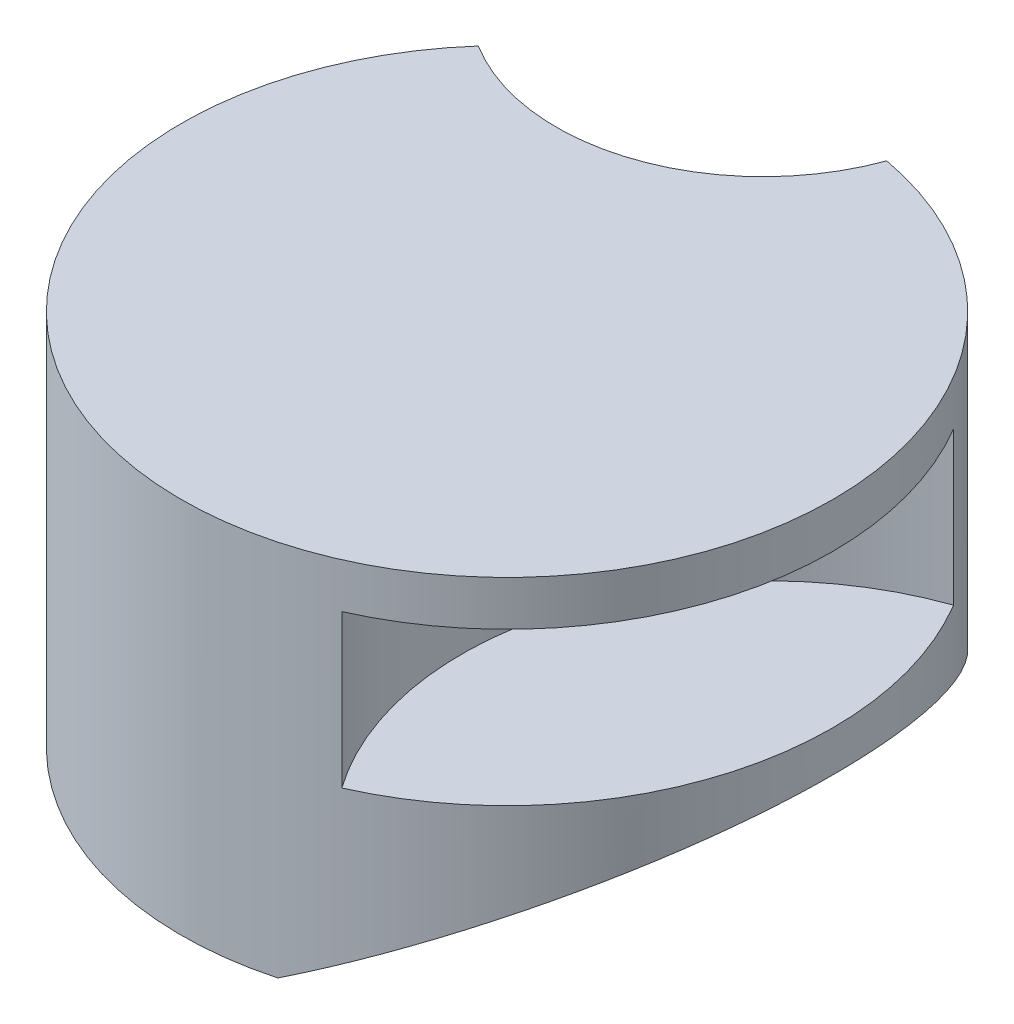
ISO-10303-21;
HEADER;
FILE_DESCRIPTION(('STEP AP214'),'2;1');
FILE_NAME('part.step','',(''),(''),'','','');
FILE_SCHEMA(('AUTOMOTIVE_DESIGN { 1 0 10303 214 1 1 1 1 }'));
ENDSEC;
DATA;
#1=APPLICATION_CONTEXT('core data for automotive mechanical design processes');
#2=APPLICATION_PROTOCOL_DEFINITION('international standard','automotive_design',2000,#1);
#3=PRODUCT_CONTEXT('',#1,'mechanical');
#4=PRODUCT('Part','Part','',(#3));
#5=PRODUCT_RELATED_PRODUCT_CATEGORY('part','',(#4));
#6=PRODUCT_DEFINITION_FORMATION('','',#4);
#7=PRODUCT_DEFINITION_CONTEXT('part definition',#1,'design');
#8=PRODUCT_DEFINITION('design','',#6,#7);
#9=PRODUCT_DEFINITION_SHAPE('','',#8);
#10=(LENGTH_UNIT() NAMED_UNIT(*) SI_UNIT(.MILLI.,.METRE.));
#11=(NAMED_UNIT(*) PLANE_ANGLE_UNIT() SI_UNIT($,.RADIAN.));
#12=(NAMED_UNIT(*) SI_UNIT($,.STERADIAN.) SOLID_ANGLE_UNIT());
#13=UNCERTAINTY_MEASURE_WITH_UNIT(LENGTH_MEASURE(1.E-05),#10,'distance_accuracy_value','');
#14=(GEOMETRIC_REPRESENTATION_CONTEXT(3) GLOBAL_UNCERTAINTY_ASSIGNED_CONTEXT((#13)) GLOBAL_UNIT_ASSIGNED_CONTEXT((#10,
#11,#12)) REPRESENTATION_CONTEXT('',''));
#15=CARTESIAN_POINT('',(0.,0.,0.));
#16=DIRECTION('',(0.,0.,1.));
#17=DIRECTION('',(1.,0.,0.));
#18=AXIS2_PLACEMENT_3D('',#15,#16,#17);
#19=CARTESIAN_POINT('',(-30.,84.,-87.));
#20=DIRECTION('',(0.,-1.,0.));
#21=DIRECTION('',(0.,0.,-1.));
#22=AXIS2_PLACEMENT_3D('',#19,#20,#21);
#23=CYLINDRICAL_SURFACE('',#22,46.);
#24=CARTESIAN_POINT('',(-30.,0.,-87.));
#25=DIRECTION('',(0.,-1.,0.));
#26=DIRECTION('',(0.,0.,1.));
#27=AXIS2_PLACEMENT_3D('',#24,#25,#26);
#28=CIRCLE('',#27,46.);
#29=CARTESIAN_POINT('',(13.2314324490294,0.,-71.2823904996653));
#30=VERTEX_POINT('',#29);
#31=CARTESIAN_POINT('',(-54.3552369123662,0.,-47.9766424440116));
#32=VERTEX_POINT('',#31);
#33=EDGE_CURVE('E179',#30,#32,#28,.T.);
#34=ORIENTED_EDGE('',*,*,#33,.T.);
#35=DIRECTION('',(0.,-1.,0.));
#36=VECTOR('',#35,1.);
#37=CARTESIAN_POINT('',(-54.3552369123662,84.,-47.9766424440116));
#38=LINE('',#37,#36);
#39=CARTESIAN_POINT('',(-54.3552369123662,84.,-47.9766424440116));
#40=VERTEX_POINT('',#39);
#41=EDGE_CURVE('E47',#40,#32,#38,.T.);
#42=ORIENTED_EDGE('',*,*,#41,.F.);
#43=CARTESIAN_POINT('',(-30.,84.,-87.));
#44=DIRECTION('',(0.,-1.,0.));
#45=DIRECTION('',(0.,0.,1.));
#46=AXIS2_PLACEMENT_3D('',#43,#44,#45);
#47=CIRCLE('',#46,46.);
#48=CARTESIAN_POINT('',(13.2314324490294,84.,-71.2823904996653));
#49=VERTEX_POINT('',#48);
#50=EDGE_CURVE('E181',#49,#40,#47,.T.);
#51=ORIENTED_EDGE('',*,*,#50,.F.);
#52=DIRECTION('',(0.,-1.,0.));
#53=VECTOR('',#52,1.);
#54=CARTESIAN_POINT('',(13.2314324490294,84.,-71.2823904996653));
#55=LINE('',#54,#53);
#56=EDGE_CURVE('E187',#49,#30,#55,.T.);
#57=ORIENTED_EDGE('',*,*,#56,.T.);
#58=EDGE_LOOP('',(#34,#42,#51,#57));
#59=FACE_BOUND('',#58,.T.);
#60=ADVANCED_FACE('F40',(#59),#23,.F.);
#61=CARTESIAN_POINT('',(0.,84.,0.));
#62=DIRECTION('',(0.,-1.,0.));
#63=DIRECTION('',(0.,0.,-1.));
#64=AXIS2_PLACEMENT_3D('',#61,#62,#63);
#65=CYLINDRICAL_SURFACE('',#64,72.5);
#66=DIRECTION('',(0.,1.,0.));
#67=VECTOR('',#66,1.);
#68=CARTESIAN_POINT('',(62.2907728367391,40.,-37.0959515230675));
#69=LINE('',#68,#67);
#70=CARTESIAN_POINT('',(62.2907728367391,40.,-37.0959515230675));
#71=VERTEX_POINT('',#70);
#72=CARTESIAN_POINT('',(62.2907728367391,74.,-37.0959515230675));
#73=VERTEX_POINT('',#72);
#74=EDGE_CURVE('E172',#71,#73,#69,.T.);
#75=ORIENTED_EDGE('',*,*,#74,.F.);
#76=CARTESIAN_POINT('',(0.,40.,0.));
#77=DIRECTION('',(0.,1.,0.));
#78=DIRECTION('',(0.,0.,-1.));
#79=AXIS2_PLACEMENT_3D('',#76,#77,#78);
#80=CIRCLE('',#79,72.5);
#81=CARTESIAN_POINT('',(29.4657333236834,40.,66.2421358328487));
#82=VERTEX_POINT('',#81);
#83=EDGE_CURVE('E167',#82,#71,#80,.T.);
#84=ORIENTED_EDGE('',*,*,#83,.F.);
#85=DIRECTION('',(0.,1.,0.));
#86=VECTOR('',#85,1.);
#87=CARTESIAN_POINT('',(29.4657333236834,40.,66.2421358328487));
#88=LINE('',#87,#86);
#89=CARTESIAN_POINT('',(29.4657333236834,74.,66.2421358328487));
#90=VERTEX_POINT('',#89);
#91=EDGE_CURVE('E176',#82,#90,#88,.T.);
#92=ORIENTED_EDGE('',*,*,#91,.T.);
#93=CARTESIAN_POINT('',(0.,74.,0.));
#94=DIRECTION('',(0.,1.,0.));
#95=DIRECTION('',(0.,0.,-1.));
#96=AXIS2_PLACEMENT_3D('',#93,#94,#95);
#97=CIRCLE('',#96,72.5);
#98=EDGE_CURVE('E166',#90,#73,#97,.T.);
#99=ORIENTED_EDGE('',*,*,#98,.T.);
#100=EDGE_LOOP('',(#75,#84,#92,#99));
#101=FACE_BOUND('',#100,.T.);
#102=CARTESIAN_POINT('',(0.,0.,0.));
#103=DIRECTION('',(0.,1.,0.));
#104=DIRECTION('',(0.,0.,1.));
#105=AXIS2_PLACEMENT_3D('',#102,#103,#104);
#106=CIRCLE('',#105,72.5);
#107=CARTESIAN_POINT('',(18.9651148571204,0.,69.9755272824452));
#108=VERTEX_POINT('',#107);
#109=EDGE_CURVE('E185',#32,#108,#106,.T.);
#110=ORIENTED_EDGE('',*,*,#109,.T.);
#111=CARTESIAN_POINT('',(0.,-10.9495141679705,0.));
#112=DIRECTION('',(-0.499999999999995,0.866025403784442,0.));
#113=DIRECTION('',(-0.866025403784442,-0.499999999999995,0.));
#114=AXIS2_PLACEMENT_3D('',#111,#112,#113);
#115=ELLIPSE('',#114,83.7157890324955,72.5);
#116=CARTESIAN_POINT('',(18.9651148571204,0.,-69.9755272824452));
#117=VERTEX_POINT('',#116);
#118=EDGE_CURVE('E53',#108,#117,#115,.T.);
#119=ORIENTED_EDGE('',*,*,#118,.T.);
#120=EDGE_CURVE('E190',#117,#30,#106,.T.);
#121=ORIENTED_EDGE('',*,*,#120,.T.);
#122=ORIENTED_EDGE('',*,*,#56,.F.);
#123=CARTESIAN_POINT('',(0.,84.,0.));
#124=DIRECTION('',(0.,1.,0.));
#125=DIRECTION('',(0.,0.,1.));
#126=AXIS2_PLACEMENT_3D('',#123,#124,#125);
#127=CIRCLE('',#126,72.5);
#128=EDGE_CURVE('E184',#40,#49,#127,.T.);
#129=ORIENTED_EDGE('',*,*,#128,.F.);
#130=ORIENTED_EDGE('',*,*,#41,.T.);
#131=EDGE_LOOP('',(#110,#119,#121,#122,#129,#130));
#132=FACE_BOUND('',#131,.T.);
#133=ADVANCED_FACE('F197',(#101,#132),#65,.T.);
#134=CARTESIAN_POINT('',(-15.,84.,-43.5));
#135=DIRECTION('',(0.,1.,0.));
#136=DIRECTION('',(0.,0.,1.));
#137=AXIS2_PLACEMENT_3D('',#134,#135,#136);
#138=PLANE('',#137);
#139=ORIENTED_EDGE('',*,*,#50,.T.);
#140=ORIENTED_EDGE('',*,*,#128,.T.);
#141=EDGE_LOOP('',(#139,#140));
#142=FACE_BOUND('',#141,.T.);
#143=ADVANCED_FACE('F223',(#142),#138,.T.);
#144=CARTESIAN_POINT('',(-15.,0.,-43.5));
#145=DIRECTION('',(0.,1.,0.));
#146=DIRECTION('',(0.,0.,1.));
#147=AXIS2_PLACEMENT_3D('',#144,#145,#146);
#148=PLANE('',#147);
#149=ORIENTED_EDGE('',*,*,#120,.F.);
#150=DIRECTION('',(0.,0.,1.));
#151=VECTOR('',#150,1.);
#152=CARTESIAN_POINT('',(18.9651148571204,0.,-43.5));
#153=LINE('',#152,#151);
#154=EDGE_CURVE('E11',#117,#108,#153,.T.);
#155=ORIENTED_EDGE('',*,*,#154,.T.);
#156=ORIENTED_EDGE('',*,*,#109,.F.);
#157=ORIENTED_EDGE('',*,*,#33,.F.);
#158=EDGE_LOOP('',(#149,#155,#156,#157));
#159=FACE_BOUND('',#158,.T.);
#160=ADVANCED_FACE('F204',(#159),#148,.F.);
#161=CARTESIAN_POINT('',(85.,40.,27.));
#162=DIRECTION('',(0.,1.,0.));
#163=DIRECTION('',(0.,0.,1.));
#164=AXIS2_PLACEMENT_3D('',#161,#162,#163);
#165=CYLINDRICAL_SURFACE('',#164,68.);
#166=CARTESIAN_POINT('',(85.,74.,27.));
#167=DIRECTION('',(0.,1.,0.));
#168=DIRECTION('',(0.,0.,1.));
#169=AXIS2_PLACEMENT_3D('',#166,#167,#168);
#170=CIRCLE('',#169,68.);
#171=EDGE_CURVE('E59',#73,#90,#170,.T.);
#172=ORIENTED_EDGE('',*,*,#171,.T.);
#173=ORIENTED_EDGE('',*,*,#91,.F.);
#174=CARTESIAN_POINT('',(85.,40.,27.));
#175=DIRECTION('',(0.,1.,0.));
#176=DIRECTION('',(0.,0.,1.));
#177=AXIS2_PLACEMENT_3D('',#174,#175,#176);
#178=CIRCLE('',#177,68.);
#179=EDGE_CURVE('E169',#71,#82,#178,.T.);
#180=ORIENTED_EDGE('',*,*,#179,.F.);
#181=ORIENTED_EDGE('',*,*,#74,.T.);
#182=EDGE_LOOP('',(#172,#173,#180,#181));
#183=FACE_BOUND('',#182,.T.);
#184=ADVANCED_FACE('F231',(#183),#165,.F.);
#185=CARTESIAN_POINT('',(42.5,40.,13.5));
#186=DIRECTION('',(0.,-1.,0.));
#187=DIRECTION('',(0.,0.,-1.));
#188=AXIS2_PLACEMENT_3D('',#185,#186,#187);
#189=PLANE('',#188);
#190=ORIENTED_EDGE('',*,*,#83,.T.);
#191=ORIENTED_EDGE('',*,*,#179,.T.);
#192=EDGE_LOOP('',(#190,#191));
#193=FACE_BOUND('',#192,.T.);
#194=ADVANCED_FACE('F214',(#193),#189,.F.);
#195=CARTESIAN_POINT('',(42.5,74.,13.5));
#196=DIRECTION('',(0.,-1.,0.));
#197=DIRECTION('',(0.,0.,-1.));
#198=AXIS2_PLACEMENT_3D('',#195,#196,#197);
#199=PLANE('',#198);
#200=ORIENTED_EDGE('',*,*,#98,.F.);
#201=ORIENTED_EDGE('',*,*,#171,.F.);
#202=EDGE_LOOP('',(#200,#201));
#203=FACE_BOUND('',#202,.T.);
#204=ADVANCED_FACE('F207',(#203),#199,.T.);
#205=CARTESIAN_POINT('',(72.5,30.9083803482768,-71.2823904996653));
#206=DIRECTION('',(-0.499999999999995,0.866025403784442,0.));
#207=DIRECTION('',(-0.866025403784442,-0.499999999999995,0.));
#208=AXIS2_PLACEMENT_3D('',#205,#206,#207);
#209=PLANE('',#208);
#210=ORIENTED_EDGE('',*,*,#154,.F.);
#211=ORIENTED_EDGE('',*,*,#118,.F.);
#212=EDGE_LOOP('',(#210,#211));
#213=FACE_BOUND('',#212,.T.);
#214=ADVANCED_FACE('F205',(#213),#209,.F.);
#215=CLOSED_SHELL('',(#60,#133,#143,#160,#184,#194,#204,#214));
#216=CARTESIAN_POINT('',(-38.6335575687742,20.,32.2705098312484));
#217=DIRECTION('',(0.,0.,1.));
#218=DIRECTION('',(1.,0.,0.));
#219=AXIS2_PLACEMENT_3D('',#216,#217,#218);
#220=PLANE('',#219);
#221=DIRECTION('',(1.,0.,0.));
#222=VECTOR('',#221,1.);
#223=CARTESIAN_POINT('',(-38.6335575687742,63.,32.2705098312484));
#224=LINE('',#223,#222);
#225=CARTESIAN_POINT('',(-38.6335575687742,63.,32.2705098312484));
#226=VERTEX_POINT('',#225);
#227=CARTESIAN_POINT('',(-3.36644243122579,63.,32.2705098312484));
#228=VERTEX_POINT('',#227);
#229=EDGE_CURVE('E122',#226,#228,#224,.T.);
#230=ORIENTED_EDGE('',*,*,#229,.T.);
#231=DIRECTION('',(0.,1.,0.));
#232=VECTOR('',#231,1.);
#233=CARTESIAN_POINT('',(-3.36644243122579,20.,32.2705098312484));
#234=LINE('',#233,#232);
#235=CARTESIAN_POINT('',(-3.36644243122579,20.,32.2705098312484));
#236=VERTEX_POINT('',#235);
#237=EDGE_CURVE('E115',#236,#228,#234,.T.);
#238=ORIENTED_EDGE('',*,*,#237,.F.);
#239=DIRECTION('',(1.,0.,0.));
#240=VECTOR('',#239,1.);
#241=CARTESIAN_POINT('',(-38.6335575687742,20.,32.2705098312484));
#242=LINE('',#241,#240);
#243=CARTESIAN_POINT('',(-38.6335575687742,20.,32.2705098312484));
#244=VERTEX_POINT('',#243);
#245=EDGE_CURVE('E119',#244,#236,#242,.T.);
#246=ORIENTED_EDGE('',*,*,#245,.F.);
#247=DIRECTION('',(0.,1.,0.));
#248=VECTOR('',#247,1.);
#249=CARTESIAN_POINT('',(-38.6335575687742,20.,32.2705098312484));
#250=LINE('',#249,#248);
#251=EDGE_CURVE('E158',#244,#226,#250,.T.);
#252=ORIENTED_EDGE('',*,*,#251,.T.);
#253=EDGE_LOOP('',(#230,#238,#246,#252));
#254=FACE_BOUND('',#253,.T.);
#255=ADVANCED_FACE('F117',(#254),#220,.F.);
#256=CARTESIAN_POINT('',(-49.5316954888546,20.,-1.27050983124841));
#257=DIRECTION('',(-0.951056516295154,0.,0.309016994374947));
#258=DIRECTION('',(0.309016994374947,0.,0.951056516295154));
#259=AXIS2_PLACEMENT_3D('',#256,#257,#258);
#260=PLANE('',#259);
#261=DIRECTION('',(0.309016994374947,0.,0.951056516295154));
#262=VECTOR('',#261,1.);
#263=CARTESIAN_POINT('',(-49.5316954888546,63.,-1.27050983124841));
#264=LINE('',#263,#262);
#265=CARTESIAN_POINT('',(-49.5316954888546,63.,-1.27050983124841));
#266=VERTEX_POINT('',#265);
#267=EDGE_CURVE('E140',#266,#226,#264,.T.);
#268=ORIENTED_EDGE('',*,*,#267,.T.);
#269=ORIENTED_EDGE('',*,*,#251,.F.);
#270=DIRECTION('',(0.309016994374947,0.,0.951056516295154));
#271=VECTOR('',#270,1.);
#272=CARTESIAN_POINT('',(-49.5316954888546,20.,-1.27050983124841));
#273=LINE('',#272,#271);
#274=CARTESIAN_POINT('',(-49.5316954888546,20.,-1.27050983124841));
#275=VERTEX_POINT('',#274);
#276=EDGE_CURVE('E127',#275,#244,#273,.T.);
#277=ORIENTED_EDGE('',*,*,#276,.F.);
#278=DIRECTION('',(0.,1.,0.));
#279=VECTOR('',#278,1.);
#280=CARTESIAN_POINT('',(-49.5316954888546,20.,-1.27050983124841));
#281=LINE('',#280,#279);
#282=EDGE_CURVE('E160',#275,#266,#281,.T.);
#283=ORIENTED_EDGE('',*,*,#282,.T.);
#284=EDGE_LOOP('',(#268,#269,#277,#283));
#285=FACE_BOUND('',#284,.T.);
#286=ADVANCED_FACE('F261',(#285),#260,.F.);
#287=CARTESIAN_POINT('',(-21.,20.,-22.));
#288=DIRECTION('',(-0.587785252292473,0.,-0.809016994374947));
#289=DIRECTION('',(-0.809016994374948,0.,0.587785252292473));
#290=AXIS2_PLACEMENT_3D('',#287,#288,#289);
#291=PLANE('',#290);
#292=DIRECTION('',(-0.809016994374947,0.,0.587785252292473));
#293=VECTOR('',#292,1.);
#294=CARTESIAN_POINT('',(-21.,63.,-22.));
#295=LINE('',#294,#293);
#296=CARTESIAN_POINT('',(-21.,63.,-22.));
#297=VERTEX_POINT('',#296);
#298=EDGE_CURVE('E143',#297,#266,#295,.T.);
#299=ORIENTED_EDGE('',*,*,#298,.T.);
#300=ORIENTED_EDGE('',*,*,#282,.F.);
#301=DIRECTION('',(-0.809016994374947,0.,0.587785252292473));
#302=VECTOR('',#301,1.);
#303=CARTESIAN_POINT('',(-21.,20.,-22.));
#304=LINE('',#303,#302);
#305=CARTESIAN_POINT('',(-21.,20.,-22.));
#306=VERTEX_POINT('',#305);
#307=EDGE_CURVE('E147',#306,#275,#304,.T.);
#308=ORIENTED_EDGE('',*,*,#307,.F.);
#309=DIRECTION('',(0.,1.,0.));
#310=VECTOR('',#309,1.);
#311=CARTESIAN_POINT('',(-21.,20.,-22.));
#312=LINE('',#311,#310);
#313=EDGE_CURVE('E162',#306,#297,#312,.T.);
#314=ORIENTED_EDGE('',*,*,#313,.T.);
#315=EDGE_LOOP('',(#299,#300,#308,#314));
#316=FACE_BOUND('',#315,.T.);
#317=ADVANCED_FACE('F270',(#316),#291,.F.);
#318=CARTESIAN_POINT('',(7.53169548885464,20.,-1.27050983124841));
#319=DIRECTION('',(0.587785252292473,0.,-0.809016994374948));
#320=DIRECTION('',(-0.809016994374948,0.,-0.587785252292473));
#321=AXIS2_PLACEMENT_3D('',#318,#319,#320);
#322=PLANE('',#321);
#323=DIRECTION('',(-0.809016994374947,0.,-0.587785252292473));
#324=VECTOR('',#323,1.);
#325=CARTESIAN_POINT('',(7.53169548885464,63.,-1.27050983124841));
#326=LINE('',#325,#324);
#327=CARTESIAN_POINT('',(7.53169548885464,63.,-1.27050983124841));
#328=VERTEX_POINT('',#327);
#329=EDGE_CURVE('E153',#328,#297,#326,.T.);
#330=ORIENTED_EDGE('',*,*,#329,.T.);
#331=ORIENTED_EDGE('',*,*,#313,.F.);
#332=DIRECTION('',(-0.809016994374947,0.,-0.587785252292473));
#333=VECTOR('',#332,1.);
#334=CARTESIAN_POINT('',(7.53169548885464,20.,-1.27050983124841));
#335=LINE('',#334,#333);
#336=CARTESIAN_POINT('',(7.53169548885464,20.,-1.27050983124841));
#337=VERTEX_POINT('',#336);
#338=EDGE_CURVE('E135',#337,#306,#335,.T.);
#339=ORIENTED_EDGE('',*,*,#338,.F.);
#340=DIRECTION('',(0.,1.,0.));
#341=VECTOR('',#340,1.);
#342=CARTESIAN_POINT('',(7.53169548885464,20.,-1.27050983124841));
#343=LINE('',#342,#341);
#344=EDGE_CURVE('E126',#337,#328,#343,.T.);
#345=ORIENTED_EDGE('',*,*,#344,.T.);
#346=EDGE_LOOP('',(#330,#331,#339,#345));
#347=FACE_BOUND('',#346,.T.);
#348=ADVANCED_FACE('F280',(#347),#322,.F.);
#349=CARTESIAN_POINT('',(-3.36644243122579,20.,32.2705098312484));
#350=DIRECTION('',(0.951056516295154,0.,0.309016994374948));
#351=DIRECTION('',(0.309016994374948,0.,-0.951056516295154));
#352=AXIS2_PLACEMENT_3D('',#349,#350,#351);
#353=PLANE('',#352);
#354=DIRECTION('',(0.309016994374948,0.,-0.951056516295154));
#355=VECTOR('',#354,1.);
#356=CARTESIAN_POINT('',(-3.36644243122579,63.,32.2705098312484));
#357=LINE('',#356,#355);
#358=EDGE_CURVE('E151',#228,#328,#357,.T.);
#359=ORIENTED_EDGE('',*,*,#358,.T.);
#360=ORIENTED_EDGE('',*,*,#344,.F.);
#361=DIRECTION('',(0.309016994374948,0.,-0.951056516295154));
#362=VECTOR('',#361,1.);
#363=CARTESIAN_POINT('',(-3.36644243122579,20.,32.2705098312484));
#364=LINE('',#363,#362);
#365=EDGE_CURVE('E130',#236,#337,#364,.T.);
#366=ORIENTED_EDGE('',*,*,#365,.F.);
#367=ORIENTED_EDGE('',*,*,#237,.T.);
#368=EDGE_LOOP('',(#359,#360,#366,#367));
#369=FACE_BOUND('',#368,.T.);
#370=ADVANCED_FACE('F131',(#369),#353,.F.);
#371=CARTESIAN_POINT('',(0.,20.,0.));
#372=DIRECTION('',(0.,1.,0.));
#373=DIRECTION('',(0.,0.,1.));
#374=AXIS2_PLACEMENT_3D('',#371,#372,#373);
#375=PLANE('',#374);
#376=ORIENTED_EDGE('',*,*,#245,.T.);
#377=ORIENTED_EDGE('',*,*,#365,.T.);
#378=ORIENTED_EDGE('',*,*,#338,.T.);
#379=ORIENTED_EDGE('',*,*,#307,.T.);
#380=ORIENTED_EDGE('',*,*,#276,.T.);
#381=EDGE_LOOP('',(#376,#377,#378,#379,#380));
#382=FACE_BOUND('',#381,.T.);
#383=ADVANCED_FACE('F137',(#382),#375,.T.);
#384=CARTESIAN_POINT('',(0.,63.,0.));
#385=DIRECTION('',(0.,1.,0.));
#386=DIRECTION('',(0.,0.,1.));
#387=AXIS2_PLACEMENT_3D('',#384,#385,#386);
#388=PLANE('',#387);
#389=ORIENTED_EDGE('',*,*,#229,.F.);
#390=ORIENTED_EDGE('',*,*,#267,.F.);
#391=ORIENTED_EDGE('',*,*,#298,.F.);
#392=ORIENTED_EDGE('',*,*,#329,.F.);
#393=ORIENTED_EDGE('',*,*,#358,.F.);
#394=EDGE_LOOP('',(#389,#390,#391,#392,#393));
#395=FACE_BOUND('',#394,.T.);
#396=ADVANCED_FACE('F307',(#395),#388,.F.);
#397=CLOSED_SHELL('',(#255,#286,#317,#348,#370,#383,#396));
#398=ORIENTED_CLOSED_SHELL('',*,#397,.T.);
#399=BREP_WITH_VOIDS('B2',#215,(#398));
#400=ADVANCED_BREP_SHAPE_REPRESENTATION('',(#18,#399),#14);
#401=SHAPE_DEFINITION_REPRESENTATION(#9,#400);
ENDSEC;
END-ISO-10303-21;
